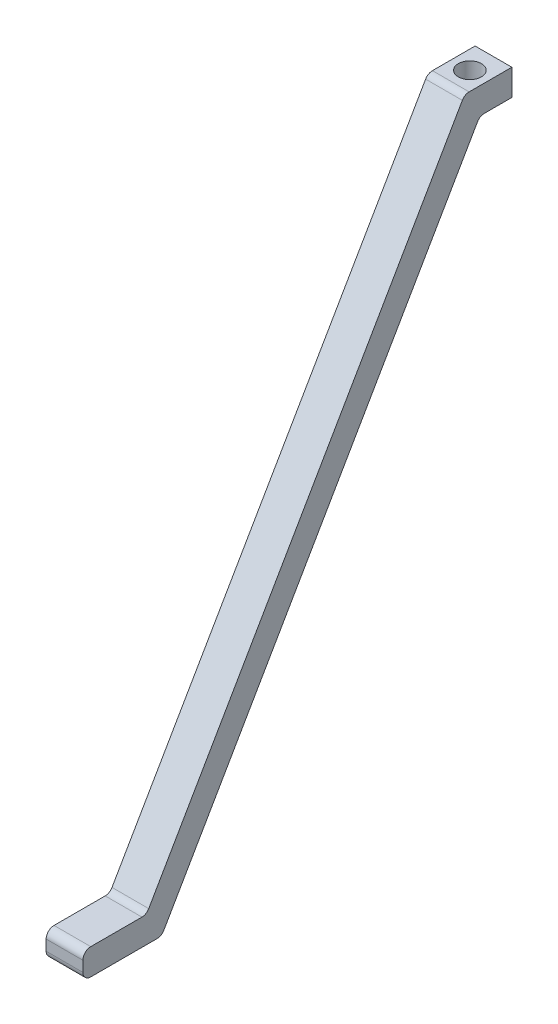
ISO-10303-21;
HEADER;
FILE_DESCRIPTION(('STEP AP214'),'2;1');
FILE_NAME('part.step','',(''),(''),'','','');
FILE_SCHEMA(('AUTOMOTIVE_DESIGN { 1 0 10303 214 1 1 1 1 }'));
ENDSEC;
DATA;
#1=APPLICATION_CONTEXT('core data for automotive mechanical design processes');
#2=APPLICATION_PROTOCOL_DEFINITION('international standard','automotive_design',2000,#1);
#3=PRODUCT_CONTEXT('',#1,'mechanical');
#4=PRODUCT('Part','Part','',(#3));
#5=PRODUCT_RELATED_PRODUCT_CATEGORY('part','',(#4));
#6=PRODUCT_DEFINITION_FORMATION('','',#4);
#7=PRODUCT_DEFINITION_CONTEXT('part definition',#1,'design');
#8=PRODUCT_DEFINITION('design','',#6,#7);
#9=PRODUCT_DEFINITION_SHAPE('','',#8);
#10=(LENGTH_UNIT() NAMED_UNIT(*) SI_UNIT(.MILLI.,.METRE.));
#11=(NAMED_UNIT(*) PLANE_ANGLE_UNIT() SI_UNIT($,.RADIAN.));
#12=(NAMED_UNIT(*) SI_UNIT($,.STERADIAN.) SOLID_ANGLE_UNIT());
#13=UNCERTAINTY_MEASURE_WITH_UNIT(LENGTH_MEASURE(1.E-05),#10,'distance_accuracy_value','');
#14=(GEOMETRIC_REPRESENTATION_CONTEXT(3) GLOBAL_UNCERTAINTY_ASSIGNED_CONTEXT((#13)) GLOBAL_UNIT_ASSIGNED_CONTEXT((#10,
#11,#12)) REPRESENTATION_CONTEXT('',''));
#15=CARTESIAN_POINT('',(0.,0.,0.));
#16=DIRECTION('',(0.,0.,1.));
#17=DIRECTION('',(1.,0.,0.));
#18=AXIS2_PLACEMENT_3D('',#15,#16,#17);
#19=CARTESIAN_POINT('',(-3.5,10.,4.5));
#20=DIRECTION('',(1.,0.,0.));
#21=DIRECTION('',(0.,0.,-1.));
#22=AXIS2_PLACEMENT_3D('',#19,#20,#21);
#23=PLANE('',#22);
#24=DIRECTION('',(0.,0.,1.));
#25=VECTOR('',#24,1.);
#26=CARTESIAN_POINT('',(-3.5,-100.,0.));
#27=LINE('',#26,#25);
#28=CARTESIAN_POINT('',(-3.49999999999999,-100.,63.1010523227467));
#29=VERTEX_POINT('',#28);
#30=CARTESIAN_POINT('',(-3.49999999999999,-100.,75.7350269189623));
#31=VERTEX_POINT('',#30);
#32=EDGE_CURVE('E356',#29,#31,#27,.T.);
#33=ORIENTED_EDGE('',*,*,#32,.T.);
#34=CARTESIAN_POINT('',(-3.5,-98.5,75.7350269189623));
#35=DIRECTION('',(1.,0.,0.));
#36=DIRECTION('',(0.,0.,-1.));
#37=AXIS2_PLACEMENT_3D('',#34,#35,#36);
#38=CIRCLE('',#37,1.5);
#39=CARTESIAN_POINT('',(-3.49999999999999,-98.5,77.2350269189623));
#40=VERTEX_POINT('',#39);
#41=EDGE_CURVE('E286',#31,#40,#38,.F.);
#42=ORIENTED_EDGE('',*,*,#41,.T.);
#43=DIRECTION('',(0.,1.,0.));
#44=VECTOR('',#43,1.);
#45=CARTESIAN_POINT('',(-3.49999999999999,0.,77.2350269189623));
#46=LINE('',#45,#44);
#47=CARTESIAN_POINT('',(-3.49999999999999,-96.5,77.2350269189623));
#48=VERTEX_POINT('',#47);
#49=EDGE_CURVE('E359',#40,#48,#46,.T.);
#50=ORIENTED_EDGE('',*,*,#49,.T.);
#51=CARTESIAN_POINT('',(-3.5,-96.5,75.7350269189623));
#52=DIRECTION('',(1.,0.,0.));
#53=DIRECTION('',(0.,0.,-1.));
#54=AXIS2_PLACEMENT_3D('',#51,#52,#53);
#55=CIRCLE('',#54,1.5);
#56=CARTESIAN_POINT('',(-3.49999999999999,-95.,75.7350269189623));
#57=VERTEX_POINT('',#56);
#58=EDGE_CURVE('E283',#48,#57,#55,.F.);
#59=ORIENTED_EDGE('',*,*,#58,.T.);
#60=DIRECTION('',(0.,0.,1.));
#61=VECTOR('',#60,1.);
#62=CARTESIAN_POINT('',(-3.5,-95.,0.));
#63=LINE('',#62,#61);
#64=CARTESIAN_POINT('',(-3.49999999999999,-95.,65.9878036686948));
#65=VERTEX_POINT('',#64);
#66=EDGE_CURVE('E324',#65,#57,#63,.T.);
#67=ORIENTED_EDGE('',*,*,#66,.F.);
#68=CARTESIAN_POINT('',(-3.5,-93.5,65.9878036686948));
#69=DIRECTION('',(1.,0.,0.));
#70=DIRECTION('',(0.,0.,-1.));
#71=AXIS2_PLACEMENT_3D('',#68,#69,#70);
#72=CIRCLE('',#71,1.5);
#73=CARTESIAN_POINT('',(-3.49999999999999,-94.25,64.6887655630182));
#74=VERTEX_POINT('',#73);
#75=EDGE_CURVE('E56',#65,#74,#72,.T.);
#76=ORIENTED_EDGE('',*,*,#75,.T.);
#77=DIRECTION('',(0.,-0.86602540378444,0.499999999999998));
#78=VECTOR('',#77,1.);
#79=CARTESIAN_POINT('',(-3.5,4.44855715851496,7.70512701892219));
#80=LINE('',#79,#78);
#81=CARTESIAN_POINT('',(-3.5,9.25,4.93301270189222));
#82=VERTEX_POINT('',#81);
#83=EDGE_CURVE('E321',#82,#74,#80,.T.);
#84=ORIENTED_EDGE('',*,*,#83,.F.);
#85=CARTESIAN_POINT('',(-3.5,8.5,3.63397459621556));
#86=DIRECTION('',(1.,0.,0.));
#87=DIRECTION('',(0.,0.,-1.));
#88=AXIS2_PLACEMENT_3D('',#85,#86,#87);
#89=CIRCLE('',#88,1.5);
#90=CARTESIAN_POINT('',(-3.5,10.,3.63397459621556));
#91=VERTEX_POINT('',#90);
#92=EDGE_CURVE('E218',#82,#91,#89,.F.);
#93=ORIENTED_EDGE('',*,*,#92,.T.);
#94=DIRECTION('',(0.,0.,1.));
#95=VECTOR('',#94,1.);
#96=CARTESIAN_POINT('',(-3.5,10.,4.5));
#97=LINE('',#96,#95);
#98=CARTESIAN_POINT('',(-3.5,10.,-4.5));
#99=VERTEX_POINT('',#98);
#100=EDGE_CURVE('E188',#99,#91,#97,.T.);
#101=ORIENTED_EDGE('',*,*,#100,.F.);
#102=DIRECTION('',(0.,-1.,0.));
#103=VECTOR('',#102,1.);
#104=CARTESIAN_POINT('',(-3.5,10.,-4.5));
#105=LINE('',#104,#103);
#106=CARTESIAN_POINT('',(-3.5,5.,-4.5));
#107=VERTEX_POINT('',#106);
#108=EDGE_CURVE('E179',#99,#107,#105,.T.);
#109=ORIENTED_EDGE('',*,*,#108,.T.);
#110=DIRECTION('',(0.,0.,-1.));
#111=VECTOR('',#110,1.);
#112=CARTESIAN_POINT('',(-3.5,5.,1.61324865405187));
#113=LINE('',#112,#111);
#114=CARTESIAN_POINT('',(-3.5,5.,0.747223250267444));
#115=VERTEX_POINT('',#114);
#116=EDGE_CURVE('E161',#115,#107,#113,.T.);
#117=ORIENTED_EDGE('',*,*,#116,.F.);
#118=CARTESIAN_POINT('',(-3.5,3.5,0.747223250267444));
#119=DIRECTION('',(1.,0.,0.));
#120=DIRECTION('',(0.,0.,-1.));
#121=AXIS2_PLACEMENT_3D('',#118,#119,#120);
#122=CIRCLE('',#121,1.5);
#123=CARTESIAN_POINT('',(-3.5,4.25,2.0462613559441));
#124=VERTEX_POINT('',#123);
#125=EDGE_CURVE('E273',#115,#124,#122,.T.);
#126=ORIENTED_EDGE('',*,*,#125,.T.);
#127=DIRECTION('',(0.,-0.86602540378444,0.499999999999998));
#128=VECTOR('',#127,1.);
#129=CARTESIAN_POINT('',(-3.5,1.94855715851498,3.37500000000001));
#130=LINE('',#129,#128);
#131=CARTESIAN_POINT('',(-3.49999999999999,-99.25,61.8020142170701));
#132=VERTEX_POINT('',#131);
#133=EDGE_CURVE('E332',#124,#132,#130,.T.);
#134=ORIENTED_EDGE('',*,*,#133,.T.);
#135=CARTESIAN_POINT('',(-3.5,-98.5,63.1010523227467));
#136=DIRECTION('',(1.,0.,0.));
#137=DIRECTION('',(0.,0.,-1.));
#138=AXIS2_PLACEMENT_3D('',#135,#136,#137);
#139=CIRCLE('',#138,1.5);
#140=EDGE_CURVE('E280',#132,#29,#139,.F.);
#141=ORIENTED_EDGE('',*,*,#140,.T.);
#142=EDGE_LOOP('',(#33,#42,#50,#59,#67,#76,#84,#93,#101,#109,#117,#126,#134,#141));
#143=FACE_BOUND('',#142,.T.);
#144=ADVANCED_FACE('F47',(#143),#23,.F.);
#145=CARTESIAN_POINT('',(3.5,10.,4.5));
#146=DIRECTION('',(-1.,0.,0.));
#147=DIRECTION('',(0.,0.,1.));
#148=AXIS2_PLACEMENT_3D('',#145,#146,#147);
#149=PLANE('',#148);
#150=DIRECTION('',(0.,-1.,0.));
#151=VECTOR('',#150,1.);
#152=CARTESIAN_POINT('',(3.50000000000003,0.,77.2350269189623));
#153=LINE('',#152,#151);
#154=CARTESIAN_POINT('',(3.50000000000003,-96.5,77.2350269189623));
#155=VERTEX_POINT('',#154);
#156=CARTESIAN_POINT('',(3.50000000000003,-98.5,77.2350269189623));
#157=VERTEX_POINT('',#156);
#158=EDGE_CURVE('E355',#155,#157,#153,.T.);
#159=ORIENTED_EDGE('',*,*,#158,.T.);
#160=CARTESIAN_POINT('',(3.5,-98.5,75.7350269189623));
#161=DIRECTION('',(-1.,0.,0.));
#162=DIRECTION('',(0.,0.,1.));
#163=AXIS2_PLACEMENT_3D('',#160,#161,#162);
#164=CIRCLE('',#163,1.5);
#165=CARTESIAN_POINT('',(3.50000000000002,-100.,75.7350269189623));
#166=VERTEX_POINT('',#165);
#167=EDGE_CURVE('E301',#157,#166,#164,.F.);
#168=ORIENTED_EDGE('',*,*,#167,.T.);
#169=DIRECTION('',(0.,0.,-1.));
#170=VECTOR('',#169,1.);
#171=CARTESIAN_POINT('',(3.5,-100.,0.));
#172=LINE('',#171,#170);
#173=CARTESIAN_POINT('',(3.50000000000002,-100.,63.1010523227467));
#174=VERTEX_POINT('',#173);
#175=EDGE_CURVE('E352',#166,#174,#172,.T.);
#176=ORIENTED_EDGE('',*,*,#175,.T.);
#177=CARTESIAN_POINT('',(3.5,-98.5,63.1010523227467));
#178=DIRECTION('',(-1.,0.,0.));
#179=DIRECTION('',(0.,0.,1.));
#180=AXIS2_PLACEMENT_3D('',#177,#178,#179);
#181=CIRCLE('',#180,1.5);
#182=CARTESIAN_POINT('',(3.50000000000001,-99.25,61.8020142170701));
#183=VERTEX_POINT('',#182);
#184=EDGE_CURVE('E63',#174,#183,#181,.F.);
#185=ORIENTED_EDGE('',*,*,#184,.T.);
#186=DIRECTION('',(0.,0.86602540378444,-0.499999999999998));
#187=VECTOR('',#186,1.);
#188=CARTESIAN_POINT('',(3.5,1.94855715851498,3.37500000000001));
#189=LINE('',#188,#187);
#190=CARTESIAN_POINT('',(3.5,4.25,2.0462613559441));
#191=VERTEX_POINT('',#190);
#192=EDGE_CURVE('E345',#183,#191,#189,.T.);
#193=ORIENTED_EDGE('',*,*,#192,.T.);
#194=CARTESIAN_POINT('',(3.5,3.5,0.747223250267443));
#195=DIRECTION('',(-1.,0.,0.));
#196=DIRECTION('',(0.,0.,1.));
#197=AXIS2_PLACEMENT_3D('',#194,#195,#196);
#198=CIRCLE('',#197,1.5);
#199=CARTESIAN_POINT('',(3.5,5.,0.747223250267443));
#200=VERTEX_POINT('',#199);
#201=EDGE_CURVE('E243',#191,#200,#198,.T.);
#202=ORIENTED_EDGE('',*,*,#201,.T.);
#203=DIRECTION('',(0.,0.,1.));
#204=VECTOR('',#203,1.);
#205=CARTESIAN_POINT('',(3.5,5.,1.61324865405187));
#206=LINE('',#205,#204);
#207=CARTESIAN_POINT('',(3.5,5.,-4.5));
#208=VERTEX_POINT('',#207);
#209=EDGE_CURVE('E184',#208,#200,#206,.T.);
#210=ORIENTED_EDGE('',*,*,#209,.F.);
#211=DIRECTION('',(0.,-1.,0.));
#212=VECTOR('',#211,1.);
#213=CARTESIAN_POINT('',(3.5,10.,-4.5));
#214=LINE('',#213,#212);
#215=CARTESIAN_POINT('',(3.5,10.,-4.5));
#216=VERTEX_POINT('',#215);
#217=EDGE_CURVE('E182',#216,#208,#214,.T.);
#218=ORIENTED_EDGE('',*,*,#217,.F.);
#219=DIRECTION('',(0.,0.,-1.));
#220=VECTOR('',#219,1.);
#221=CARTESIAN_POINT('',(3.5,10.,4.5));
#222=LINE('',#221,#220);
#223=CARTESIAN_POINT('',(3.5,10.,3.63397459621556));
#224=VERTEX_POINT('',#223);
#225=EDGE_CURVE('E196',#224,#216,#222,.T.);
#226=ORIENTED_EDGE('',*,*,#225,.F.);
#227=CARTESIAN_POINT('',(3.5,8.5,3.63397459621556));
#228=DIRECTION('',(-1.,0.,0.));
#229=DIRECTION('',(0.,0.,1.));
#230=AXIS2_PLACEMENT_3D('',#227,#228,#229);
#231=CIRCLE('',#230,1.5);
#232=CARTESIAN_POINT('',(3.5,9.25,4.93301270189222));
#233=VERTEX_POINT('',#232);
#234=EDGE_CURVE('E211',#224,#233,#231,.F.);
#235=ORIENTED_EDGE('',*,*,#234,.T.);
#236=DIRECTION('',(0.,0.86602540378444,-0.499999999999998));
#237=VECTOR('',#236,1.);
#238=CARTESIAN_POINT('',(3.5,4.44855715851496,7.70512701892219));
#239=LINE('',#238,#237);
#240=CARTESIAN_POINT('',(3.50000000000001,-94.25,64.6887655630182));
#241=VERTEX_POINT('',#240);
#242=EDGE_CURVE('E341',#241,#233,#239,.T.);
#243=ORIENTED_EDGE('',*,*,#242,.F.);
#244=CARTESIAN_POINT('',(3.5,-93.5,65.9878036686948));
#245=DIRECTION('',(-1.,0.,0.));
#246=DIRECTION('',(0.,0.,1.));
#247=AXIS2_PLACEMENT_3D('',#244,#245,#246);
#248=CIRCLE('',#247,1.5);
#249=CARTESIAN_POINT('',(3.50000000000002,-95.,65.9878036686948));
#250=VERTEX_POINT('',#249);
#251=EDGE_CURVE('E11',#241,#250,#248,.T.);
#252=ORIENTED_EDGE('',*,*,#251,.T.);
#253=DIRECTION('',(0.,0.,-1.));
#254=VECTOR('',#253,1.);
#255=CARTESIAN_POINT('',(3.5,-95.,0.));
#256=LINE('',#255,#254);
#257=CARTESIAN_POINT('',(3.50000000000002,-95.,75.7350269189623));
#258=VERTEX_POINT('',#257);
#259=EDGE_CURVE('E338',#258,#250,#256,.T.);
#260=ORIENTED_EDGE('',*,*,#259,.F.);
#261=CARTESIAN_POINT('',(3.5,-96.5,75.7350269189623));
#262=DIRECTION('',(-1.,0.,0.));
#263=DIRECTION('',(0.,0.,1.));
#264=AXIS2_PLACEMENT_3D('',#261,#262,#263);
#265=CIRCLE('',#264,1.5);
#266=EDGE_CURVE('E298',#258,#155,#265,.F.);
#267=ORIENTED_EDGE('',*,*,#266,.T.);
#268=EDGE_LOOP('',(#159,#168,#176,#185,#193,#202,#210,#218,#226,#235,#243,#252,#260,#267));
#269=FACE_BOUND('',#268,.T.);
#270=ADVANCED_FACE('F378',(#269),#149,.F.);
#271=CARTESIAN_POINT('',(3.5,10.,-4.5));
#272=DIRECTION('',(0.,0.,1.));
#273=DIRECTION('',(1.,0.,0.));
#274=AXIS2_PLACEMENT_3D('',#271,#272,#273);
#275=PLANE('',#274);
#276=ORIENTED_EDGE('',*,*,#217,.T.);
#277=DIRECTION('',(-1.,0.,0.));
#278=VECTOR('',#277,1.);
#279=CARTESIAN_POINT('',(13.795630140987,5.,-4.5));
#280=LINE('',#279,#278);
#281=EDGE_CURVE('E165',#208,#107,#280,.T.);
#282=ORIENTED_EDGE('',*,*,#281,.T.);
#283=ORIENTED_EDGE('',*,*,#108,.F.);
#284=DIRECTION('',(-1.,0.,0.));
#285=VECTOR('',#284,1.);
#286=CARTESIAN_POINT('',(3.5,10.,-4.5));
#287=LINE('',#286,#285);
#288=EDGE_CURVE('E190',#216,#99,#287,.T.);
#289=ORIENTED_EDGE('',*,*,#288,.F.);
#290=EDGE_LOOP('',(#276,#282,#283,#289));
#291=FACE_BOUND('',#290,.T.);
#292=ADVANCED_FACE('F177',(#291),#275,.F.);
#293=CARTESIAN_POINT('',(0.,10.,0.));
#294=DIRECTION('',(0.,1.,0.));
#295=DIRECTION('',(0.,0.,1.));
#296=AXIS2_PLACEMENT_3D('',#293,#294,#295);
#297=PLANE('',#296);
#298=CARTESIAN_POINT('',(0.,10.,0.));
#299=DIRECTION('',(0.,1.,0.));
#300=DIRECTION('',(0.,0.,1.));
#301=AXIS2_PLACEMENT_3D('',#298,#299,#300);
#302=CIRCLE('',#301,2.2);
#303=CARTESIAN_POINT('',(0.,10.,2.2));
#304=VERTEX_POINT('',#303);
#305=EDGE_CURVE('E368',#304,#304,#302,.T.);
#306=ORIENTED_EDGE('',*,*,#305,.F.);
#307=EDGE_LOOP('',(#306));
#308=FACE_BOUND('',#307,.T.);
#309=ORIENTED_EDGE('',*,*,#100,.T.);
#310=DIRECTION('',(1.,0.,0.));
#311=VECTOR('',#310,1.);
#312=CARTESIAN_POINT('',(3.5,10.,3.63397459621556));
#313=LINE('',#312,#311);
#314=EDGE_CURVE('E207',#91,#224,#313,.T.);
#315=ORIENTED_EDGE('',*,*,#314,.T.);
#316=ORIENTED_EDGE('',*,*,#225,.T.);
#317=ORIENTED_EDGE('',*,*,#288,.T.);
#318=EDGE_LOOP('',(#309,#315,#316,#317));
#319=FACE_BOUND('',#318,.T.);
#320=ADVANCED_FACE('F376',(#308,#319),#297,.T.);
#321=CARTESIAN_POINT('',(0.,-6.22253967444162,0.));
#322=DIRECTION('',(0.,1.,0.));
#323=DIRECTION('',(0.,0.,1.));
#324=AXIS2_PLACEMENT_3D('',#321,#322,#323);
#325=CYLINDRICAL_SURFACE('',#324,2.2);
#326=CARTESIAN_POINT('',(0.,5.,0.));
#327=DIRECTION('',(0.,1.,0.));
#328=DIRECTION('',(0.,0.,1.));
#329=AXIS2_PLACEMENT_3D('',#326,#327,#328);
#330=CIRCLE('',#329,2.2);
#331=CARTESIAN_POINT('',(-2.06921661849594,5.,0.747223250267444));
#332=VERTEX_POINT('',#331);
#333=CARTESIAN_POINT('',(2.06921661849594,5.,0.747223250267443));
#334=VERTEX_POINT('',#333);
#335=EDGE_CURVE('E203',#332,#334,#330,.F.);
#336=ORIENTED_EDGE('',*,*,#335,.T.);
#337=CARTESIAN_POINT('',(2.06921661849594,5.,0.747223250267443));
#338=CARTESIAN_POINT('',(2.05398987618514,5.00000644365189,0.789420325664846));
#339=CARTESIAN_POINT('',(2.03746202829239,4.99822010700589,0.831119700759728));
#340=CARTESIAN_POINT('',(2.00203473439706,4.99136012177385,0.913146892411137));
#341=CARTESIAN_POINT('',(1.98313903389361,4.98629161332965,0.953476749979921));
#342=CARTESIAN_POINT('',(1.94343585862682,4.97325501877078,1.03197279608016));
#343=CARTESIAN_POINT('',(1.92265863168265,4.96532824516281,1.07016127744996));
#344=CARTESIAN_POINT('',(1.87918608397144,4.94686738829612,1.1447826858686));
#345=CARTESIAN_POINT('',(1.85648986784455,4.93633208348165,1.18121478083789));
#346=CARTESIAN_POINT('',(1.77498278623565,4.89586921486821,1.30399089083682));
#347=CARTESIAN_POINT('',(1.71180198231655,4.86007778853463,1.38558848677226));
#348=CARTESIAN_POINT('',(1.5772628208495,4.77813223247586,1.53709085161455));
#349=CARTESIAN_POINT('',(1.5058309627109,4.73188078106009,1.60687428762273));
#350=CARTESIAN_POINT('',(1.38318748800885,4.64979195174659,1.71197176426747));
#351=CARTESIAN_POINT('',(1.33360588697634,4.61594350499888,1.75082245403416));
#352=CARTESIAN_POINT('',(1.23233646738904,4.54600552382885,1.82352221803255));
#353=CARTESIAN_POINT('',(1.18064734149824,4.50991459085043,1.85736812558468));
#354=CARTESIAN_POINT('',(1.07638390158044,4.43685219940579,1.91964270715791));
#355=CARTESIAN_POINT('',(1.02384118984766,4.39990742706735,1.94815625875206));
#356=CARTESIAN_POINT('',(0.917130738632682,4.32531527864999,2.00059393027544));
#357=CARTESIAN_POINT('',(0.862965640562933,4.28766907871482,2.02452508622004));
#358=CARTESIAN_POINT('',(0.807969345439431,4.25,2.0462613559441));
#359=B_SPLINE_CURVE_WITH_KNOTS('',3,(#337,#338,#339,#340,#341,#342,#343,#344,#345,#346,#347,
#348,#349,#350,#351,#352,#353,#354,#355,#356,#357,#358),.UNSPECIFIED.,.F.,.F.,(4,2,2,2,2,2,2,2,
2,2,4),(0.,0.13448486253364,0.268759618780741,0.401166671229807,0.53363584657881,
0.859414189576099,1.18835834757765,1.40265200840339,1.61708068450091,1.82773448367283,
2.03806219533701),.UNSPECIFIED.);
#360=CARTESIAN_POINT('',(0.807969345439419,4.25,2.0462613559441));
#361=VERTEX_POINT('',#360);
#362=EDGE_CURVE('E234',#334,#361,#359,.T.);
#363=ORIENTED_EDGE('',*,*,#362,.T.);
#364=CARTESIAN_POINT('',(0.,7.79422863405994,0.));
#365=DIRECTION('',(0.,0.5,0.866025403784439));
#366=DIRECTION('',(0.,0.866025403784438,-0.5));
#367=AXIS2_PLACEMENT_3D('',#364,#365,#366);
#368=ELLIPSE('',#367,4.4,2.2);
#369=CARTESIAN_POINT('',(-0.807969345439474,4.25,2.0462613559441));
#370=VERTEX_POINT('',#369);
#371=EDGE_CURVE('E194',#361,#370,#368,.F.);
#372=ORIENTED_EDGE('',*,*,#371,.T.);
#373=CARTESIAN_POINT('',(-0.807969345439439,4.25,2.0462613559441));
#374=CARTESIAN_POINT('',(-0.869952684472657,4.29247409833107,2.02175523359296));
#375=CARTESIAN_POINT('',(-0.930900946607187,4.33490761564198,1.99446270576149));
#376=CARTESIAN_POINT('',(-1.05078836587779,4.41880566254145,1.93401125959424));
#377=CARTESIAN_POINT('',(-1.10972174748985,4.46026731434977,1.90083692962555));
#378=CARTESIAN_POINT('',(-1.226363860356,4.54183439008131,1.82779620961112));
#379=CARTESIAN_POINT('',(-1.28403064343208,4.58190127918872,1.78781878762512));
#380=CARTESIAN_POINT('',(-1.39649479937948,4.65881423416,1.70141943143998));
#381=CARTESIAN_POINT('',(-1.45129558288551,4.69566416496915,1.65500540894432));
#382=CARTESIAN_POINT('',(-1.56972400885975,4.7730662076238,1.54401302920877));
#383=CARTESIAN_POINT('',(-1.63248415285603,4.81252149941209,1.47771192698171));
#384=CARTESIAN_POINT('',(-1.7506689411457,4.8820665182576,1.33552039188358));
#385=CARTESIAN_POINT('',(-1.80615532080227,4.91223845530917,1.25972302533619));
#386=CARTESIAN_POINT('',(-1.89919713857871,4.956306171213,1.11317787970683));
#387=CARTESIAN_POINT('',(-1.93818505423354,4.97214669953344,1.04394703087972));
#388=CARTESIAN_POINT('',(-1.99142919571006,4.98854449812458,0.935871295575033));
#389=CARTESIAN_POINT('',(-2.00839569229508,4.99278622819996,0.898890506607818));
#390=CARTESIAN_POINT('',(-2.04034028555762,4.99851696955526,0.823821597908829));
#391=CARTESIAN_POINT('',(-2.0553159544134,5.00000264789606,0.785732193946464));
#392=CARTESIAN_POINT('',(-2.06921661849594,5.,0.747223250267444));
#393=B_SPLINE_CURVE_WITH_KNOTS('',3,(#373,#374,#375,#376,#377,#378,#379,#380,#381,#382,#383,
#384,#385,#386,#387,#388,#389,#390,#391,#392),.UNSPECIFIED.,.F.,.F.,(4,2,2,2,2,2,2,2,2,4),(0.,
0.237095236837926,0.474821153021727,0.716883440764688,0.958650786370905,1.25600564562315,
1.55064595565617,1.79265006133433,1.91523194478773,2.03796197215379),.UNSPECIFIED.);
#394=EDGE_CURVE('E265',#370,#332,#393,.T.);
#395=ORIENTED_EDGE('',*,*,#394,.T.);
#396=EDGE_LOOP('',(#336,#363,#372,#395));
#397=FACE_BOUND('',#396,.T.);
#398=ORIENTED_EDGE('',*,*,#305,.T.);
#399=EDGE_LOOP('',(#398));
#400=FACE_BOUND('',#399,.T.);
#401=ADVANCED_FACE('F245',(#397,#400),#325,.F.);
#402=CARTESIAN_POINT('',(135.372605725762,-100.,0.));
#403=DIRECTION('',(0.,-1.,0.));
#404=DIRECTION('',(0.,0.,-1.));
#405=AXIS2_PLACEMENT_3D('',#402,#403,#404);
#406=PLANE('',#405);
#407=ORIENTED_EDGE('',*,*,#175,.F.);
#408=DIRECTION('',(-1.,0.,0.));
#409=VECTOR('',#408,1.);
#410=CARTESIAN_POINT('',(135.372605725762,-100.,75.7350269189622));
#411=LINE('',#410,#409);
#412=EDGE_CURVE('E276',#166,#31,#411,.T.);
#413=ORIENTED_EDGE('',*,*,#412,.T.);
#414=ORIENTED_EDGE('',*,*,#32,.F.);
#415=DIRECTION('',(-1.,0.,0.));
#416=VECTOR('',#415,1.);
#417=CARTESIAN_POINT('',(135.372605725762,-100.,63.1010523227467));
#418=LINE('',#417,#416);
#419=EDGE_CURVE('E272',#29,#174,#418,.F.);
#420=ORIENTED_EDGE('',*,*,#419,.T.);
#421=EDGE_LOOP('',(#407,#413,#414,#420));
#422=FACE_BOUND('',#421,.T.);
#423=ADVANCED_FACE('F400',(#422),#406,.T.);
#424=CARTESIAN_POINT('',(135.372605725762,1.94855715851498,3.37499999999998));
#425=DIRECTION('',(0.,-0.499999999999998,-0.86602540378444));
#426=DIRECTION('',(0.,0.86602540378444,-0.499999999999998));
#427=AXIS2_PLACEMENT_3D('',#424,#425,#426);
#428=PLANE('',#427);
#429=ORIENTED_EDGE('',*,*,#192,.F.);
#430=DIRECTION('',(-1.,0.,0.));
#431=VECTOR('',#430,1.);
#432=CARTESIAN_POINT('',(135.372605725762,-99.25,61.80201421707));
#433=LINE('',#432,#431);
#434=EDGE_CURVE('E314',#183,#132,#433,.T.);
#435=ORIENTED_EDGE('',*,*,#434,.T.);
#436=ORIENTED_EDGE('',*,*,#133,.F.);
#437=DIRECTION('',(-1.,0.,0.));
#438=VECTOR('',#437,1.);
#439=CARTESIAN_POINT('',(135.372605725762,4.25,2.04626135594408));
#440=LINE('',#439,#438);
#441=EDGE_CURVE('E227',#124,#370,#440,.F.);
#442=ORIENTED_EDGE('',*,*,#441,.T.);
#443=ORIENTED_EDGE('',*,*,#371,.F.);
#444=DIRECTION('',(-1.,0.,0.));
#445=VECTOR('',#444,1.);
#446=CARTESIAN_POINT('',(135.372605725762,4.25,2.04626135594408));
#447=LINE('',#446,#445);
#448=EDGE_CURVE('E230',#361,#191,#447,.F.);
#449=ORIENTED_EDGE('',*,*,#448,.T.);
#450=EDGE_LOOP('',(#429,#435,#436,#442,#443,#449));
#451=FACE_BOUND('',#450,.T.);
#452=ADVANCED_FACE('F389',(#451),#428,.T.);
#453=CARTESIAN_POINT('',(135.372605725762,4.44855715851496,7.70512701892217));
#454=DIRECTION('',(0.,-0.499999999999998,-0.86602540378444));
#455=DIRECTION('',(0.,0.86602540378444,-0.499999999999998));
#456=AXIS2_PLACEMENT_3D('',#453,#454,#455);
#457=PLANE('',#456);
#458=ORIENTED_EDGE('',*,*,#83,.T.);
#459=DIRECTION('',(-1.,0.,0.));
#460=VECTOR('',#459,1.);
#461=CARTESIAN_POINT('',(3.5,-94.25,64.6887655630182));
#462=LINE('',#461,#460);
#463=EDGE_CURVE('E311',#74,#241,#462,.F.);
#464=ORIENTED_EDGE('',*,*,#463,.T.);
#465=ORIENTED_EDGE('',*,*,#242,.T.);
#466=DIRECTION('',(1.,0.,0.));
#467=VECTOR('',#466,1.);
#468=CARTESIAN_POINT('',(-3.5,9.25,4.93301270189222));
#469=LINE('',#468,#467);
#470=EDGE_CURVE('E215',#233,#82,#469,.F.);
#471=ORIENTED_EDGE('',*,*,#470,.T.);
#472=EDGE_LOOP('',(#458,#464,#465,#471));
#473=FACE_BOUND('',#472,.T.);
#474=ADVANCED_FACE('F329',(#473),#457,.F.);
#475=CARTESIAN_POINT('',(135.372605725762,-95.,0.));
#476=DIRECTION('',(0.,-1.,0.));
#477=DIRECTION('',(0.,0.,-1.));
#478=AXIS2_PLACEMENT_3D('',#475,#476,#477);
#479=PLANE('',#478);
#480=ORIENTED_EDGE('',*,*,#66,.T.);
#481=DIRECTION('',(-1.,0.,0.));
#482=VECTOR('',#481,1.);
#483=CARTESIAN_POINT('',(3.50000000000003,-95.,75.7350269189623));
#484=LINE('',#483,#482);
#485=EDGE_CURVE('E308',#57,#258,#484,.F.);
#486=ORIENTED_EDGE('',*,*,#485,.T.);
#487=ORIENTED_EDGE('',*,*,#259,.T.);
#488=DIRECTION('',(-1.,0.,0.));
#489=VECTOR('',#488,1.);
#490=CARTESIAN_POINT('',(-3.49999999999998,-95.,65.9878036686948));
#491=LINE('',#490,#489);
#492=EDGE_CURVE('E304',#250,#65,#491,.T.);
#493=ORIENTED_EDGE('',*,*,#492,.T.);
#494=EDGE_LOOP('',(#480,#486,#487,#493));
#495=FACE_BOUND('',#494,.T.);
#496=ADVANCED_FACE('F336',(#495),#479,.F.);
#497=CARTESIAN_POINT('',(135.372605725762,0.,77.2350269189622));
#498=DIRECTION('',(0.,0.,1.));
#499=DIRECTION('',(1.,0.,0.));
#500=AXIS2_PLACEMENT_3D('',#497,#498,#499);
#501=PLANE('',#500);
#502=ORIENTED_EDGE('',*,*,#49,.F.);
#503=DIRECTION('',(-1.,0.,0.));
#504=VECTOR('',#503,1.);
#505=CARTESIAN_POINT('',(135.372605725762,-98.5,77.2350269189622));
#506=LINE('',#505,#504);
#507=EDGE_CURVE('E293',#40,#157,#506,.F.);
#508=ORIENTED_EDGE('',*,*,#507,.T.);
#509=ORIENTED_EDGE('',*,*,#158,.F.);
#510=DIRECTION('',(-1.,0.,0.));
#511=VECTOR('',#510,1.);
#512=CARTESIAN_POINT('',(-3.49999999999998,-96.5,77.2350269189623));
#513=LINE('',#512,#511);
#514=EDGE_CURVE('E289',#155,#48,#513,.T.);
#515=ORIENTED_EDGE('',*,*,#514,.T.);
#516=EDGE_LOOP('',(#502,#508,#509,#515));
#517=FACE_BOUND('',#516,.T.);
#518=ADVANCED_FACE('F430',(#517),#501,.T.);
#519=CARTESIAN_POINT('',(13.795630140987,5.,1.61324865405187));
#520=DIRECTION('',(0.,1.,0.));
#521=DIRECTION('',(0.,0.,1.));
#522=AXIS2_PLACEMENT_3D('',#519,#520,#521);
#523=PLANE('',#522);
#524=ORIENTED_EDGE('',*,*,#209,.T.);
#525=DIRECTION('',(-1.,0.,0.));
#526=VECTOR('',#525,1.);
#527=CARTESIAN_POINT('',(13.795630140987,5.,0.747223250267441));
#528=LINE('',#527,#526);
#529=EDGE_CURVE('E223',#200,#334,#528,.T.);
#530=ORIENTED_EDGE('',*,*,#529,.T.);
#531=ORIENTED_EDGE('',*,*,#335,.F.);
#532=DIRECTION('',(-1.,0.,0.));
#533=VECTOR('',#532,1.);
#534=CARTESIAN_POINT('',(13.795630140987,5.,0.747223250267441));
#535=LINE('',#534,#533);
#536=EDGE_CURVE('E169',#332,#115,#535,.T.);
#537=ORIENTED_EDGE('',*,*,#536,.T.);
#538=ORIENTED_EDGE('',*,*,#116,.T.);
#539=ORIENTED_EDGE('',*,*,#281,.F.);
#540=EDGE_LOOP('',(#524,#530,#531,#537,#538,#539));
#541=FACE_BOUND('',#540,.T.);
#542=ADVANCED_FACE('F164',(#541),#523,.F.);
#543=CARTESIAN_POINT('',(0.,8.5,3.63397459621556));
#544=DIRECTION('',(-1.,0.,0.));
#545=DIRECTION('',(0.,0.,1.));
#546=AXIS2_PLACEMENT_3D('',#543,#544,#545);
#547=CYLINDRICAL_SURFACE('',#546,1.5);
#548=ORIENTED_EDGE('',*,*,#92,.F.);
#549=ORIENTED_EDGE('',*,*,#470,.F.);
#550=ORIENTED_EDGE('',*,*,#234,.F.);
#551=ORIENTED_EDGE('',*,*,#314,.F.);
#552=EDGE_LOOP('',(#548,#549,#550,#551));
#553=FACE_BOUND('',#552,.T.);
#554=ADVANCED_FACE('F255',(#553),#547,.T.);
#555=CARTESIAN_POINT('',(13.795630140987,3.5,0.747223250267441));
#556=DIRECTION('',(-1.,0.,0.));
#557=DIRECTION('',(0.,0.,1.));
#558=AXIS2_PLACEMENT_3D('',#555,#556,#557);
#559=CYLINDRICAL_SURFACE('',#558,1.5);
#560=ORIENTED_EDGE('',*,*,#201,.F.);
#561=ORIENTED_EDGE('',*,*,#448,.F.);
#562=ORIENTED_EDGE('',*,*,#362,.F.);
#563=ORIENTED_EDGE('',*,*,#529,.F.);
#564=EDGE_LOOP('',(#560,#561,#562,#563));
#565=FACE_BOUND('',#564,.T.);
#566=ADVANCED_FACE('F249',(#565),#559,.F.);
#567=CARTESIAN_POINT('',(13.795630140987,3.5,0.747223250267441));
#568=DIRECTION('',(-1.,0.,0.));
#569=DIRECTION('',(0.,0.,1.));
#570=AXIS2_PLACEMENT_3D('',#567,#568,#569);
#571=CYLINDRICAL_SURFACE('',#570,1.5);
#572=ORIENTED_EDGE('',*,*,#394,.F.);
#573=ORIENTED_EDGE('',*,*,#441,.F.);
#574=ORIENTED_EDGE('',*,*,#125,.F.);
#575=ORIENTED_EDGE('',*,*,#536,.F.);
#576=EDGE_LOOP('',(#572,#573,#574,#575));
#577=FACE_BOUND('',#576,.T.);
#578=ADVANCED_FACE('F254',(#577),#571,.F.);
#579=CARTESIAN_POINT('',(135.372605725762,-98.5,75.7350269189622));
#580=DIRECTION('',(-1.,0.,0.));
#581=DIRECTION('',(0.,0.,1.));
#582=AXIS2_PLACEMENT_3D('',#579,#580,#581);
#583=CYLINDRICAL_SURFACE('',#582,1.5);
#584=ORIENTED_EDGE('',*,*,#167,.F.);
#585=ORIENTED_EDGE('',*,*,#507,.F.);
#586=ORIENTED_EDGE('',*,*,#41,.F.);
#587=ORIENTED_EDGE('',*,*,#412,.F.);
#588=EDGE_LOOP('',(#584,#585,#586,#587));
#589=FACE_BOUND('',#588,.T.);
#590=ADVANCED_FACE('F261',(#589),#583,.T.);
#591=CARTESIAN_POINT('',(135.372605725762,-96.5,75.7350269189622));
#592=DIRECTION('',(1.,0.,0.));
#593=DIRECTION('',(0.,0.,-1.));
#594=AXIS2_PLACEMENT_3D('',#591,#592,#593);
#595=CYLINDRICAL_SURFACE('',#594,1.5);
#596=ORIENTED_EDGE('',*,*,#266,.F.);
#597=ORIENTED_EDGE('',*,*,#485,.F.);
#598=ORIENTED_EDGE('',*,*,#58,.F.);
#599=ORIENTED_EDGE('',*,*,#514,.F.);
#600=EDGE_LOOP('',(#596,#597,#598,#599));
#601=FACE_BOUND('',#600,.T.);
#602=ADVANCED_FACE('F406',(#601),#595,.T.);
#603=CARTESIAN_POINT('',(135.372605725762,-93.5,65.9878036686948));
#604=DIRECTION('',(1.,0.,0.));
#605=DIRECTION('',(0.,0.,-1.));
#606=AXIS2_PLACEMENT_3D('',#603,#604,#605);
#607=CYLINDRICAL_SURFACE('',#606,1.5);
#608=ORIENTED_EDGE('',*,*,#251,.F.);
#609=ORIENTED_EDGE('',*,*,#463,.F.);
#610=ORIENTED_EDGE('',*,*,#75,.F.);
#611=ORIENTED_EDGE('',*,*,#492,.F.);
#612=EDGE_LOOP('',(#608,#609,#610,#611));
#613=FACE_BOUND('',#612,.T.);
#614=ADVANCED_FACE('F334',(#613),#607,.F.);
#615=CARTESIAN_POINT('',(135.372605725762,-98.5,63.1010523227467));
#616=DIRECTION('',(-1.,0.,0.));
#617=DIRECTION('',(0.,0.,1.));
#618=AXIS2_PLACEMENT_3D('',#615,#616,#617);
#619=CYLINDRICAL_SURFACE('',#618,1.5);
#620=ORIENTED_EDGE('',*,*,#184,.F.);
#621=ORIENTED_EDGE('',*,*,#419,.F.);
#622=ORIENTED_EDGE('',*,*,#140,.F.);
#623=ORIENTED_EDGE('',*,*,#434,.F.);
#624=EDGE_LOOP('',(#620,#621,#622,#623));
#625=FACE_BOUND('',#624,.T.);
#626=ADVANCED_FACE('F49',(#625),#619,.T.);
#627=CLOSED_SHELL('',(#144,#270,#292,#320,#401,#423,#452,#474,#496,#518,#542,#554,#566,#578,
#590,#602,#614,#626));
#628=MANIFOLD_SOLID_BREP('B2',#627);
#629=ADVANCED_BREP_SHAPE_REPRESENTATION('',(#18,#628),#14);
#630=SHAPE_DEFINITION_REPRESENTATION(#9,#629);
ENDSEC;
END-ISO-10303-21;
